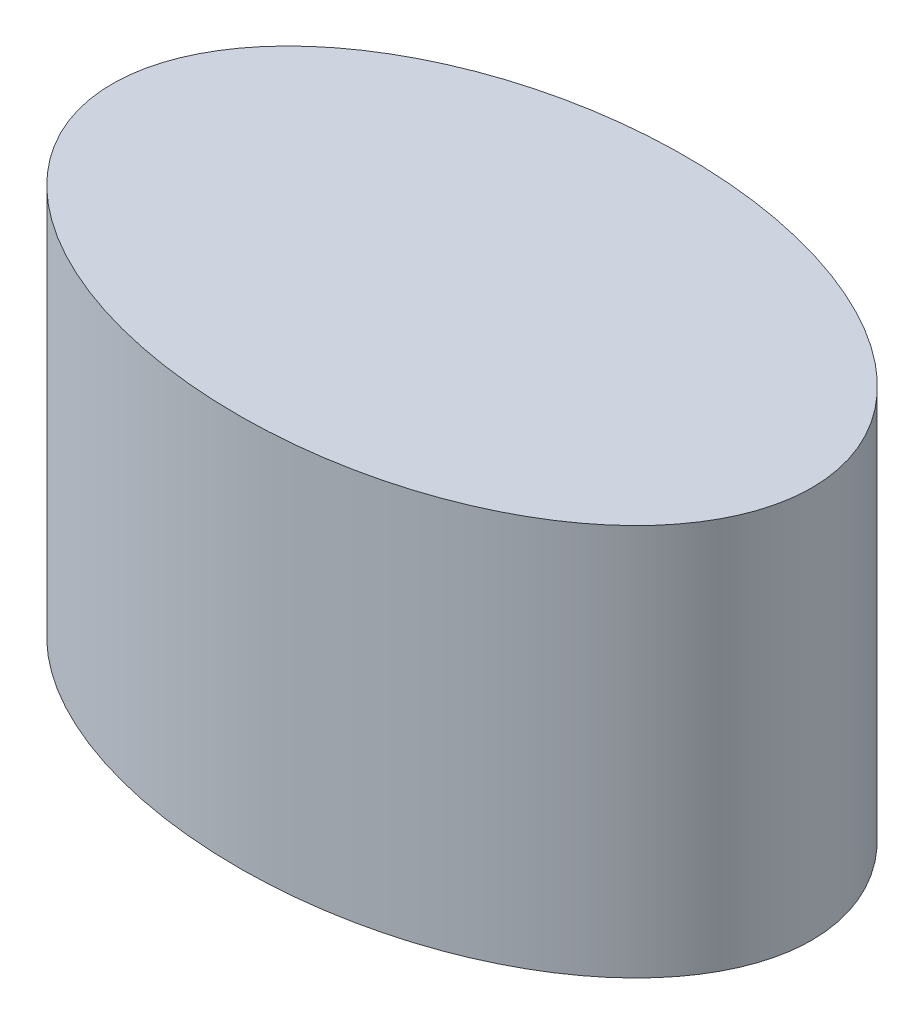
ISO-10303-21;
HEADER;
FILE_DESCRIPTION(('STEP AP214'),'2;1');
FILE_NAME('part.step','',(''),(''),'','','');
FILE_SCHEMA(('AUTOMOTIVE_DESIGN { 1 0 10303 214 1 1 1 1 }'));
ENDSEC;
DATA;
#1=APPLICATION_CONTEXT('core data for automotive mechanical design processes');
#2=APPLICATION_PROTOCOL_DEFINITION('international standard','automotive_design',2000,#1);
#3=PRODUCT_CONTEXT('',#1,'mechanical');
#4=PRODUCT('Part','Part','',(#3));
#5=PRODUCT_RELATED_PRODUCT_CATEGORY('part','',(#4));
#6=PRODUCT_DEFINITION_FORMATION('','',#4);
#7=PRODUCT_DEFINITION_CONTEXT('part definition',#1,'design');
#8=PRODUCT_DEFINITION('design','',#6,#7);
#9=PRODUCT_DEFINITION_SHAPE('','',#8);
#10=(LENGTH_UNIT() NAMED_UNIT(*) SI_UNIT(.MILLI.,.METRE.));
#11=(NAMED_UNIT(*) PLANE_ANGLE_UNIT() SI_UNIT($,.RADIAN.));
#12=(NAMED_UNIT(*) SI_UNIT($,.STERADIAN.) SOLID_ANGLE_UNIT());
#13=UNCERTAINTY_MEASURE_WITH_UNIT(LENGTH_MEASURE(1.E-05),#10,'distance_accuracy_value','');
#14=(GEOMETRIC_REPRESENTATION_CONTEXT(3) GLOBAL_UNCERTAINTY_ASSIGNED_CONTEXT((#13)) GLOBAL_UNIT_ASSIGNED_CONTEXT((#10,
#11,#12)) REPRESENTATION_CONTEXT('',''));
#15=CARTESIAN_POINT('',(0.,0.,0.));
#16=DIRECTION('',(0.,0.,1.));
#17=DIRECTION('',(1.,0.,0.));
#18=AXIS2_PLACEMENT_3D('',#15,#16,#17);
#19=CARTESIAN_POINT('',(0.,28.,0.));
#20=DIRECTION('',(0.,1.,0.));
#21=DIRECTION('',(1.,0.,0.));
#22=AXIS2_PLACEMENT_3D('',#19,#20,#21);
#23=ELLIPSE('',#22,25.,16.);
#24=DIRECTION('',(0.,-1.,0.));
#25=VECTOR('',#24,1.);
#26=SURFACE_OF_LINEAR_EXTRUSION('',#23,#25);
#27=CARTESIAN_POINT('',(25.,28.,0.));
#28=VERTEX_POINT('',#27);
#29=EDGE_CURVE('E10',#28,#28,#23,.T.);
#30=ORIENTED_EDGE('',*,*,#29,.F.);
#31=EDGE_LOOP('',(#30));
#32=FACE_BOUND('',#31,.T.);
#33=CARTESIAN_POINT('',(0.,0.,0.));
#34=DIRECTION('',(0.,1.,0.));
#35=DIRECTION('',(1.,0.,0.));
#36=AXIS2_PLACEMENT_3D('',#33,#34,#35);
#37=ELLIPSE('',#36,25.,16.);
#38=CARTESIAN_POINT('',(25.,0.,0.));
#39=VERTEX_POINT('',#38);
#40=EDGE_CURVE('E39',#39,#39,#37,.T.);
#41=ORIENTED_EDGE('',*,*,#40,.T.);
#42=EDGE_LOOP('',(#41));
#43=FACE_BOUND('',#42,.T.);
#44=ADVANCED_FACE('F35',(#32,#43),#26,.F.);
#45=CARTESIAN_POINT('',(0.,28.,0.));
#46=DIRECTION('',(0.,1.,0.));
#47=DIRECTION('',(0.,0.,1.));
#48=AXIS2_PLACEMENT_3D('',#45,#46,#47);
#49=PLANE('',#48);
#50=ORIENTED_EDGE('',*,*,#29,.T.);
#51=EDGE_LOOP('',(#50));
#52=FACE_BOUND('',#51,.T.);
#53=ADVANCED_FACE('F51',(#52),#49,.T.);
#54=CARTESIAN_POINT('',(0.,0.,0.));
#55=DIRECTION('',(0.,1.,0.));
#56=DIRECTION('',(0.,0.,1.));
#57=AXIS2_PLACEMENT_3D('',#54,#55,#56);
#58=PLANE('',#57);
#59=ORIENTED_EDGE('',*,*,#40,.F.);
#60=EDGE_LOOP('',(#59));
#61=FACE_BOUND('',#60,.T.);
#62=ADVANCED_FACE('F49',(#61),#58,.F.);
#63=CLOSED_SHELL('',(#44,#53,#62));
#64=MANIFOLD_SOLID_BREP('B2',#63);
#65=ADVANCED_BREP_SHAPE_REPRESENTATION('',(#18,#64),#14);
#66=SHAPE_DEFINITION_REPRESENTATION(#9,#65);
ENDSEC;
END-ISO-10303-21;
